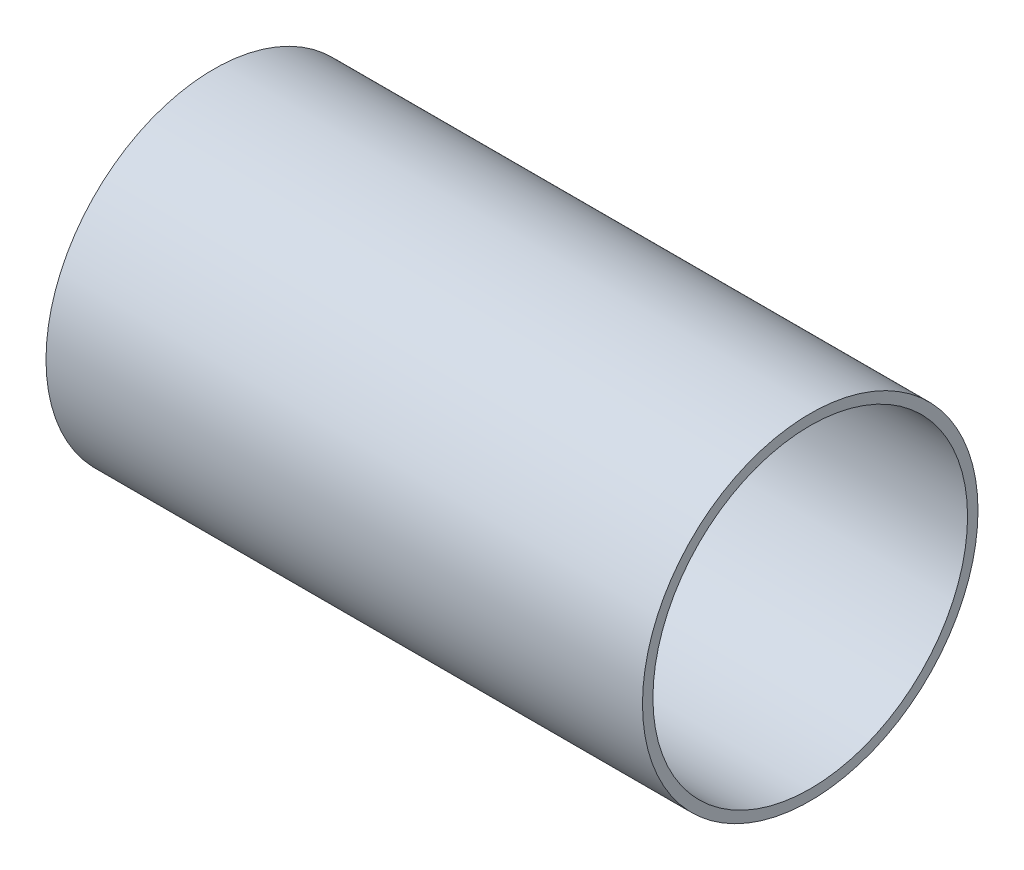
ISO-10303-21;
HEADER;
FILE_DESCRIPTION(('STEP AP214'),'2;1');
FILE_NAME('part.step','',(''),(''),'','','');
FILE_SCHEMA(('AUTOMOTIVE_DESIGN { 1 0 10303 214 1 1 1 1 }'));
ENDSEC;
DATA;
#1=APPLICATION_CONTEXT('core data for automotive mechanical design processes');
#2=APPLICATION_PROTOCOL_DEFINITION('international standard','automotive_design',2000,#1);
#3=PRODUCT_CONTEXT('',#1,'mechanical');
#4=PRODUCT('Part','Part','',(#3));
#5=PRODUCT_RELATED_PRODUCT_CATEGORY('part','',(#4));
#6=PRODUCT_DEFINITION_FORMATION('','',#4);
#7=PRODUCT_DEFINITION_CONTEXT('part definition',#1,'design');
#8=PRODUCT_DEFINITION('design','',#6,#7);
#9=PRODUCT_DEFINITION_SHAPE('','',#8);
#10=(LENGTH_UNIT() NAMED_UNIT(*) SI_UNIT(.MILLI.,.METRE.));
#11=(NAMED_UNIT(*) PLANE_ANGLE_UNIT() SI_UNIT($,.RADIAN.));
#12=(NAMED_UNIT(*) SI_UNIT($,.STERADIAN.) SOLID_ANGLE_UNIT());
#13=UNCERTAINTY_MEASURE_WITH_UNIT(LENGTH_MEASURE(1.E-05),#10,'distance_accuracy_value','');
#14=(GEOMETRIC_REPRESENTATION_CONTEXT(3) GLOBAL_UNCERTAINTY_ASSIGNED_CONTEXT((#13)) GLOBAL_UNIT_ASSIGNED_CONTEXT((#10,
#11,#12)) REPRESENTATION_CONTEXT('',''));
#15=CARTESIAN_POINT('',(0.,0.,0.));
#16=DIRECTION('',(0.,0.,1.));
#17=DIRECTION('',(1.,0.,0.));
#18=AXIS2_PLACEMENT_3D('',#15,#16,#17);
#19=CARTESIAN_POINT('',(25.4,0.,0.));
#20=DIRECTION('',(1.,0.,0.));
#21=DIRECTION('',(0.,0.,-1.));
#22=AXIS2_PLACEMENT_3D('',#19,#20,#21);
#23=PLANE('',#22);
#24=CARTESIAN_POINT('',(25.4,0.,0.));
#25=DIRECTION('',(1.,0.,0.));
#26=DIRECTION('',(0.,0.,-1.));
#27=AXIS2_PLACEMENT_3D('',#24,#25,#26);
#28=CIRCLE('',#27,14.2875);
#29=CARTESIAN_POINT('',(25.4,0.,-14.2875));
#30=VERTEX_POINT('',#29);
#31=EDGE_CURVE('E10',#30,#30,#28,.T.);
#32=ORIENTED_EDGE('',*,*,#31,.T.);
#33=EDGE_LOOP('',(#32));
#34=FACE_BOUND('',#33,.T.);
#35=CARTESIAN_POINT('',(25.4,0.,0.));
#36=DIRECTION('',(1.,0.,0.));
#37=DIRECTION('',(0.,0.,-1.));
#38=AXIS2_PLACEMENT_3D('',#35,#36,#37);
#39=CIRCLE('',#38,13.3985);
#40=CARTESIAN_POINT('',(25.4,0.,-13.3985));
#41=VERTEX_POINT('',#40);
#42=EDGE_CURVE('E50',#41,#41,#39,.T.);
#43=ORIENTED_EDGE('',*,*,#42,.F.);
#44=EDGE_LOOP('',(#43));
#45=FACE_BOUND('',#44,.T.);
#46=ADVANCED_FACE('F37',(#34,#45),#23,.T.);
#47=CARTESIAN_POINT('',(-25.4,0.,0.));
#48=DIRECTION('',(1.,0.,0.));
#49=DIRECTION('',(0.,0.,-1.));
#50=AXIS2_PLACEMENT_3D('',#47,#48,#49);
#51=PLANE('',#50);
#52=CARTESIAN_POINT('',(-25.4,0.,0.));
#53=DIRECTION('',(1.,0.,0.));
#54=DIRECTION('',(0.,0.,-1.));
#55=AXIS2_PLACEMENT_3D('',#52,#53,#54);
#56=CIRCLE('',#55,14.2875);
#57=CARTESIAN_POINT('',(-25.4,0.,-14.2875));
#58=VERTEX_POINT('',#57);
#59=EDGE_CURVE('E41',#58,#58,#56,.T.);
#60=ORIENTED_EDGE('',*,*,#59,.F.);
#61=EDGE_LOOP('',(#60));
#62=FACE_BOUND('',#61,.T.);
#63=CARTESIAN_POINT('',(-25.4,0.,0.));
#64=DIRECTION('',(1.,0.,0.));
#65=DIRECTION('',(0.,0.,-1.));
#66=AXIS2_PLACEMENT_3D('',#63,#64,#65);
#67=CIRCLE('',#66,13.3985);
#68=CARTESIAN_POINT('',(-25.4,0.,-13.3985));
#69=VERTEX_POINT('',#68);
#70=EDGE_CURVE('E52',#69,#69,#67,.T.);
#71=ORIENTED_EDGE('',*,*,#70,.T.);
#72=EDGE_LOOP('',(#71));
#73=FACE_BOUND('',#72,.T.);
#74=ADVANCED_FACE('F64',(#62,#73),#51,.F.);
#75=CARTESIAN_POINT('',(25.4,0.,0.));
#76=DIRECTION('',(-1.,0.,0.));
#77=DIRECTION('',(0.,0.,1.));
#78=AXIS2_PLACEMENT_3D('',#75,#76,#77);
#79=CYLINDRICAL_SURFACE('',#78,14.2875);
#80=ORIENTED_EDGE('',*,*,#31,.F.);
#81=EDGE_LOOP('',(#80));
#82=FACE_BOUND('',#81,.T.);
#83=ORIENTED_EDGE('',*,*,#59,.T.);
#84=EDGE_LOOP('',(#83));
#85=FACE_BOUND('',#84,.T.);
#86=ADVANCED_FACE('F39',(#82,#85),#79,.T.);
#87=CARTESIAN_POINT('',(25.4,0.,0.));
#88=DIRECTION('',(-1.,0.,0.));
#89=DIRECTION('',(0.,0.,1.));
#90=AXIS2_PLACEMENT_3D('',#87,#88,#89);
#91=CYLINDRICAL_SURFACE('',#90,13.3985);
#92=ORIENTED_EDGE('',*,*,#42,.T.);
#93=EDGE_LOOP('',(#92));
#94=FACE_BOUND('',#93,.T.);
#95=ORIENTED_EDGE('',*,*,#70,.F.);
#96=EDGE_LOOP('',(#95));
#97=FACE_BOUND('',#96,.T.);
#98=ADVANCED_FACE('F60',(#94,#97),#91,.F.);
#99=CLOSED_SHELL('',(#46,#74,#86,#98));
#100=MANIFOLD_SOLID_BREP('B2',#99);
#101=ADVANCED_BREP_SHAPE_REPRESENTATION('',(#18,#100),#14);
#102=SHAPE_DEFINITION_REPRESENTATION(#9,#101);
ENDSEC;
END-ISO-10303-21;
